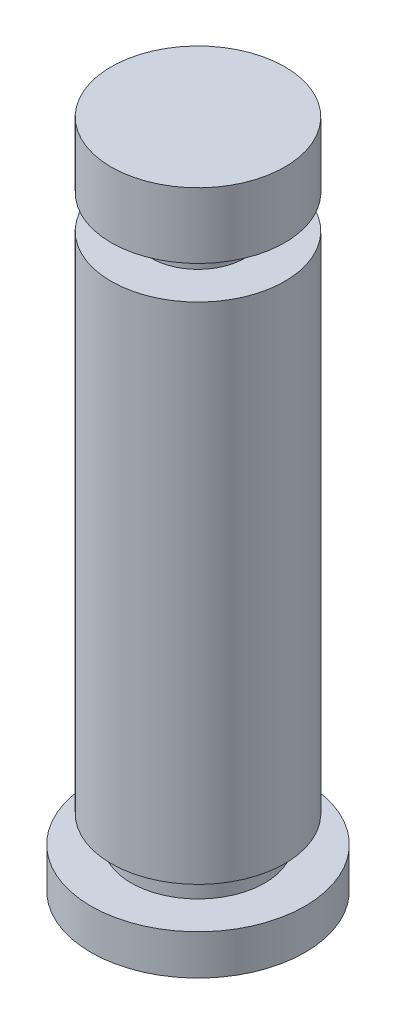
ISO-10303-21;
HEADER;
FILE_DESCRIPTION(('STEP AP214'),'2;1');
FILE_NAME('part.step','',(''),(''),'','','');
FILE_SCHEMA(('AUTOMOTIVE_DESIGN { 1 0 10303 214 1 1 1 1 }'));
ENDSEC;
DATA;
#1=APPLICATION_CONTEXT('core data for automotive mechanical design processes');
#2=APPLICATION_PROTOCOL_DEFINITION('international standard','automotive_design',2000,#1);
#3=PRODUCT_CONTEXT('',#1,'mechanical');
#4=PRODUCT('Part','Part','',(#3));
#5=PRODUCT_RELATED_PRODUCT_CATEGORY('part','',(#4));
#6=PRODUCT_DEFINITION_FORMATION('','',#4);
#7=PRODUCT_DEFINITION_CONTEXT('part definition',#1,'design');
#8=PRODUCT_DEFINITION('design','',#6,#7);
#9=PRODUCT_DEFINITION_SHAPE('','',#8);
#10=(LENGTH_UNIT() NAMED_UNIT(*) SI_UNIT(.MILLI.,.METRE.));
#11=(NAMED_UNIT(*) PLANE_ANGLE_UNIT() SI_UNIT($,.RADIAN.));
#12=(NAMED_UNIT(*) SI_UNIT($,.STERADIAN.) SOLID_ANGLE_UNIT());
#13=UNCERTAINTY_MEASURE_WITH_UNIT(LENGTH_MEASURE(1.E-05),#10,'distance_accuracy_value','');
#14=(GEOMETRIC_REPRESENTATION_CONTEXT(3) GLOBAL_UNCERTAINTY_ASSIGNED_CONTEXT((#13)) GLOBAL_UNIT_ASSIGNED_CONTEXT((#10,
#11,#12)) REPRESENTATION_CONTEXT('',''));
#15=CARTESIAN_POINT('',(0.,0.,0.));
#16=DIRECTION('',(0.,0.,1.));
#17=DIRECTION('',(1.,0.,0.));
#18=AXIS2_PLACEMENT_3D('',#15,#16,#17);
#19=CARTESIAN_POINT('',(0.,0.,0.));
#20=DIRECTION('',(0.,1.,0.));
#21=DIRECTION('',(0.,0.,1.));
#22=AXIS2_PLACEMENT_3D('',#19,#20,#21);
#23=PLANE('',#22);
#24=CARTESIAN_POINT('',(0.,0.,0.));
#25=DIRECTION('',(0.,-1.,0.));
#26=DIRECTION('',(0.,0.,-1.));
#27=AXIS2_PLACEMENT_3D('',#24,#25,#26);
#28=CIRCLE('',#27,8.);
#29=CARTESIAN_POINT('',(0.,0.,-8.));
#30=VERTEX_POINT('',#29);
#31=EDGE_CURVE('E10',#30,#30,#28,.T.);
#32=ORIENTED_EDGE('',*,*,#31,.T.);
#33=EDGE_LOOP('',(#32));
#34=FACE_BOUND('',#33,.T.);
#35=ADVANCED_FACE('F31',(#34),#23,.F.);
#36=CARTESIAN_POINT('',(0.,0.,0.));
#37=DIRECTION('',(0.,-1.,0.));
#38=DIRECTION('',(0.,0.,-1.));
#39=AXIS2_PLACEMENT_3D('',#36,#37,#38);
#40=CYLINDRICAL_SURFACE('',#39,8.);
#41=ORIENTED_EDGE('',*,*,#31,.F.);
#42=EDGE_LOOP('',(#41));
#43=FACE_BOUND('',#42,.T.);
#44=CARTESIAN_POINT('',(0.,3.,0.));
#45=DIRECTION('',(0.,-1.,0.));
#46=DIRECTION('',(0.,0.,-1.));
#47=AXIS2_PLACEMENT_3D('',#44,#45,#46);
#48=CIRCLE('',#47,8.);
#49=CARTESIAN_POINT('',(0.,3.,-8.));
#50=VERTEX_POINT('',#49);
#51=EDGE_CURVE('E37',#50,#50,#48,.T.);
#52=ORIENTED_EDGE('',*,*,#51,.T.);
#53=EDGE_LOOP('',(#52));
#54=FACE_BOUND('',#53,.T.);
#55=ADVANCED_FACE('F81',(#43,#54),#40,.T.);
#56=CARTESIAN_POINT('',(-8.,3.,0.));
#57=DIRECTION('',(0.,-1.,0.));
#58=DIRECTION('',(0.,0.,-1.));
#59=AXIS2_PLACEMENT_3D('',#56,#57,#58);
#60=PLANE('',#59);
#61=ORIENTED_EDGE('',*,*,#51,.F.);
#62=EDGE_LOOP('',(#61));
#63=FACE_BOUND('',#62,.T.);
#64=CARTESIAN_POINT('',(0.,3.,0.));
#65=DIRECTION('',(0.,-1.,0.));
#66=DIRECTION('',(0.,0.,-1.));
#67=AXIS2_PLACEMENT_3D('',#64,#65,#66);
#68=CIRCLE('',#67,5.);
#69=CARTESIAN_POINT('',(0.,3.,-5.));
#70=VERTEX_POINT('',#69);
#71=EDGE_CURVE('E41',#70,#70,#68,.T.);
#72=ORIENTED_EDGE('',*,*,#71,.T.);
#73=EDGE_LOOP('',(#72));
#74=FACE_BOUND('',#73,.T.);
#75=ADVANCED_FACE('F85',(#63,#74),#60,.F.);
#76=CARTESIAN_POINT('',(0.,0.,0.));
#77=DIRECTION('',(0.,-1.,0.));
#78=DIRECTION('',(0.,0.,-1.));
#79=AXIS2_PLACEMENT_3D('',#76,#77,#78);
#80=CYLINDRICAL_SURFACE('',#79,5.);
#81=ORIENTED_EDGE('',*,*,#71,.F.);
#82=EDGE_LOOP('',(#81));
#83=FACE_BOUND('',#82,.T.);
#84=CARTESIAN_POINT('',(0.,5.,0.));
#85=DIRECTION('',(0.,-1.,0.));
#86=DIRECTION('',(0.,0.,-1.));
#87=AXIS2_PLACEMENT_3D('',#84,#85,#86);
#88=CIRCLE('',#87,5.);
#89=CARTESIAN_POINT('',(0.,5.,-5.));
#90=VERTEX_POINT('',#89);
#91=EDGE_CURVE('E45',#90,#90,#88,.T.);
#92=ORIENTED_EDGE('',*,*,#91,.T.);
#93=EDGE_LOOP('',(#92));
#94=FACE_BOUND('',#93,.T.);
#95=ADVANCED_FACE('F90',(#83,#94),#80,.T.);
#96=CARTESIAN_POINT('',(-5.,5.,0.));
#97=DIRECTION('',(0.,1.,0.));
#98=DIRECTION('',(0.,0.,1.));
#99=AXIS2_PLACEMENT_3D('',#96,#97,#98);
#100=PLANE('',#99);
#101=ORIENTED_EDGE('',*,*,#91,.F.);
#102=EDGE_LOOP('',(#101));
#103=FACE_BOUND('',#102,.T.);
#104=CARTESIAN_POINT('',(0.,5.,0.));
#105=DIRECTION('',(0.,-1.,0.));
#106=DIRECTION('',(0.,0.,-1.));
#107=AXIS2_PLACEMENT_3D('',#104,#105,#106);
#108=CIRCLE('',#107,6.4925);
#109=CARTESIAN_POINT('',(0.,5.,-6.4925));
#110=VERTEX_POINT('',#109);
#111=EDGE_CURVE('E50',#110,#110,#108,.T.);
#112=ORIENTED_EDGE('',*,*,#111,.T.);
#113=EDGE_LOOP('',(#112));
#114=FACE_BOUND('',#113,.T.);
#115=ADVANCED_FACE('F96',(#103,#114),#100,.F.);
#116=CARTESIAN_POINT('',(0.,0.,0.));
#117=DIRECTION('',(0.,-1.,0.));
#118=DIRECTION('',(0.,0.,-1.));
#119=AXIS2_PLACEMENT_3D('',#116,#117,#118);
#120=CYLINDRICAL_SURFACE('',#119,6.4925);
#121=ORIENTED_EDGE('',*,*,#111,.F.);
#122=EDGE_LOOP('',(#121));
#123=FACE_BOUND('',#122,.T.);
#124=CARTESIAN_POINT('',(0.,42.7,0.));
#125=DIRECTION('',(0.,-1.,0.));
#126=DIRECTION('',(0.,0.,-1.));
#127=AXIS2_PLACEMENT_3D('',#124,#125,#126);
#128=CIRCLE('',#127,6.4925);
#129=CARTESIAN_POINT('',(0.,42.7,-6.4925));
#130=VERTEX_POINT('',#129);
#131=EDGE_CURVE('E53',#130,#130,#128,.T.);
#132=ORIENTED_EDGE('',*,*,#131,.T.);
#133=EDGE_LOOP('',(#132));
#134=FACE_BOUND('',#133,.T.);
#135=ADVANCED_FACE('F100',(#123,#134),#120,.T.);
#136=CARTESIAN_POINT('',(-6.4925,42.7,0.));
#137=DIRECTION('',(0.,-1.,0.));
#138=DIRECTION('',(0.,0.,-1.));
#139=AXIS2_PLACEMENT_3D('',#136,#137,#138);
#140=PLANE('',#139);
#141=ORIENTED_EDGE('',*,*,#131,.F.);
#142=EDGE_LOOP('',(#141));
#143=FACE_BOUND('',#142,.T.);
#144=CARTESIAN_POINT('',(0.,42.7,0.));
#145=DIRECTION('',(0.,-1.,0.));
#146=DIRECTION('',(0.,0.,-1.));
#147=AXIS2_PLACEMENT_3D('',#144,#145,#146);
#148=CIRCLE('',#147,3.50000000000001);
#149=CARTESIAN_POINT('',(0.,42.7,-3.50000000000001));
#150=VERTEX_POINT('',#149);
#151=EDGE_CURVE('E56',#150,#150,#148,.T.);
#152=ORIENTED_EDGE('',*,*,#151,.T.);
#153=EDGE_LOOP('',(#152));
#154=FACE_BOUND('',#153,.T.);
#155=ADVANCED_FACE('F104',(#143,#154),#140,.F.);
#156=CARTESIAN_POINT('',(0.,0.,0.));
#157=DIRECTION('',(0.,-1.,0.));
#158=DIRECTION('',(0.,0.,-1.));
#159=AXIS2_PLACEMENT_3D('',#156,#157,#158);
#160=CYLINDRICAL_SURFACE('',#159,3.50000000000001);
#161=ORIENTED_EDGE('',*,*,#151,.F.);
#162=EDGE_LOOP('',(#161));
#163=FACE_BOUND('',#162,.T.);
#164=CARTESIAN_POINT('',(0.,45.2,0.));
#165=DIRECTION('',(0.,-1.,0.));
#166=DIRECTION('',(0.,0.,-1.));
#167=AXIS2_PLACEMENT_3D('',#164,#165,#166);
#168=CIRCLE('',#167,3.50000000000001);
#169=CARTESIAN_POINT('',(0.,45.2,-3.50000000000001));
#170=VERTEX_POINT('',#169);
#171=EDGE_CURVE('E59',#170,#170,#168,.T.);
#172=ORIENTED_EDGE('',*,*,#171,.T.);
#173=EDGE_LOOP('',(#172));
#174=FACE_BOUND('',#173,.T.);
#175=ADVANCED_FACE('F108',(#163,#174),#160,.T.);
#176=CARTESIAN_POINT('',(-3.50000000000001,45.2,0.));
#177=DIRECTION('',(0.,1.,0.));
#178=DIRECTION('',(0.,0.,1.));
#179=AXIS2_PLACEMENT_3D('',#176,#177,#178);
#180=PLANE('',#179);
#181=ORIENTED_EDGE('',*,*,#171,.F.);
#182=EDGE_LOOP('',(#181));
#183=FACE_BOUND('',#182,.T.);
#184=CARTESIAN_POINT('',(0.,45.2,0.));
#185=DIRECTION('',(0.,-1.,0.));
#186=DIRECTION('',(0.,0.,-1.));
#187=AXIS2_PLACEMENT_3D('',#184,#185,#186);
#188=CIRCLE('',#187,6.4925);
#189=CARTESIAN_POINT('',(0.,45.2,-6.4925));
#190=VERTEX_POINT('',#189);
#191=EDGE_CURVE('E62',#190,#190,#188,.T.);
#192=ORIENTED_EDGE('',*,*,#191,.T.);
#193=EDGE_LOOP('',(#192));
#194=FACE_BOUND('',#193,.T.);
#195=ADVANCED_FACE('F77',(#183,#194),#180,.F.);
#196=CARTESIAN_POINT('',(0.,0.,0.));
#197=DIRECTION('',(0.,-1.,0.));
#198=DIRECTION('',(0.,0.,-1.));
#199=AXIS2_PLACEMENT_3D('',#196,#197,#198);
#200=CYLINDRICAL_SURFACE('',#199,6.4925);
#201=ORIENTED_EDGE('',*,*,#191,.F.);
#202=EDGE_LOOP('',(#201));
#203=FACE_BOUND('',#202,.T.);
#204=CARTESIAN_POINT('',(0.,50.1,0.));
#205=DIRECTION('',(0.,-1.,0.));
#206=DIRECTION('',(0.,0.,-1.));
#207=AXIS2_PLACEMENT_3D('',#204,#205,#206);
#208=CIRCLE('',#207,6.4925);
#209=CARTESIAN_POINT('',(0.,50.1,-6.4925));
#210=VERTEX_POINT('',#209);
#211=EDGE_CURVE('E65',#210,#210,#208,.T.);
#212=ORIENTED_EDGE('',*,*,#211,.T.);
#213=EDGE_LOOP('',(#212));
#214=FACE_BOUND('',#213,.T.);
#215=ADVANCED_FACE('F69',(#203,#214),#200,.T.);
#216=CARTESIAN_POINT('',(-6.4925,50.1,0.));
#217=DIRECTION('',(0.,-1.,0.));
#218=DIRECTION('',(0.,0.,-1.));
#219=AXIS2_PLACEMENT_3D('',#216,#217,#218);
#220=PLANE('',#219);
#221=ORIENTED_EDGE('',*,*,#211,.F.);
#222=EDGE_LOOP('',(#221));
#223=FACE_BOUND('',#222,.T.);
#224=ADVANCED_FACE('F71',(#223),#220,.F.);
#225=CLOSED_SHELL('',(#35,#55,#75,#95,#115,#135,#155,#175,#195,#215,#224));
#226=MANIFOLD_SOLID_BREP('B2',#225);
#227=ADVANCED_BREP_SHAPE_REPRESENTATION('',(#18,#226),#14);
#228=SHAPE_DEFINITION_REPRESENTATION(#9,#227);
ENDSEC;
END-ISO-10303-21;
